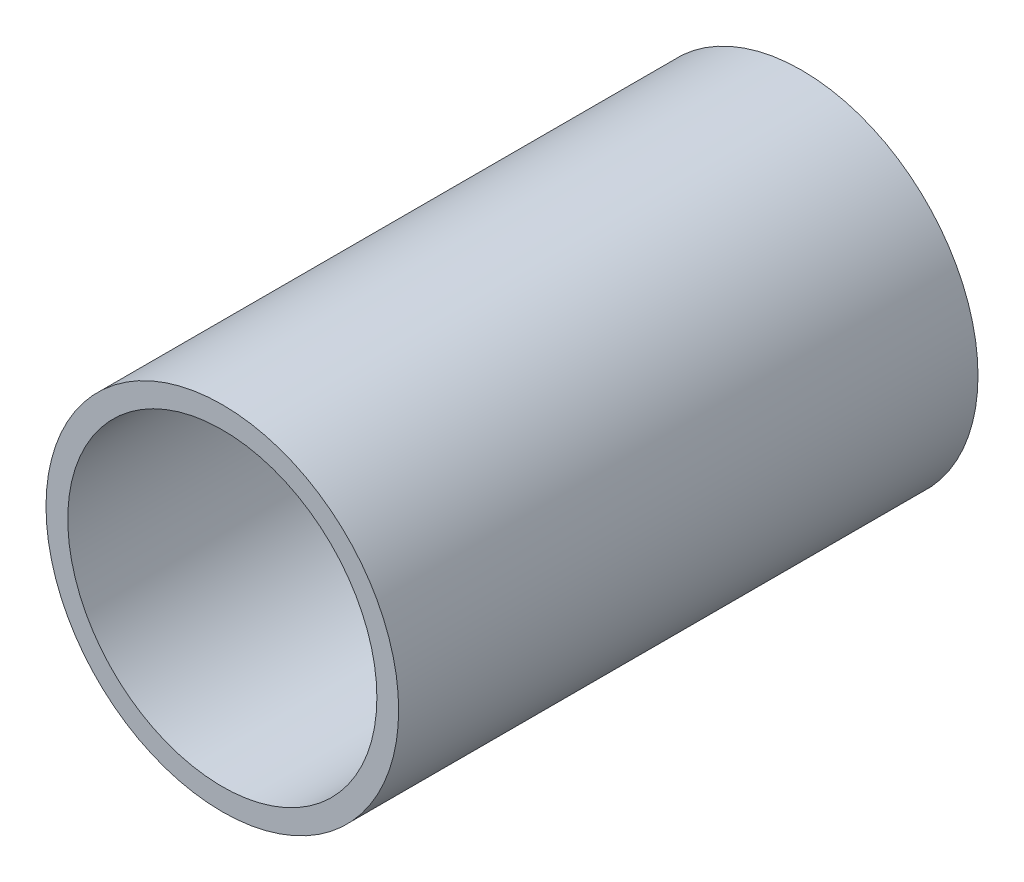
ISO-10303-21;
HEADER;
FILE_DESCRIPTION(('STEP AP214'),'2;1');
FILE_NAME('part.step','',(''),(''),'','','');
FILE_SCHEMA(('AUTOMOTIVE_DESIGN { 1 0 10303 214 1 1 1 1 }'));
ENDSEC;
DATA;
#1=APPLICATION_CONTEXT('core data for automotive mechanical design processes');
#2=APPLICATION_PROTOCOL_DEFINITION('international standard','automotive_design',2000,#1);
#3=PRODUCT_CONTEXT('',#1,'mechanical');
#4=PRODUCT('Part','Part','',(#3));
#5=PRODUCT_RELATED_PRODUCT_CATEGORY('part','',(#4));
#6=PRODUCT_DEFINITION_FORMATION('','',#4);
#7=PRODUCT_DEFINITION_CONTEXT('part definition',#1,'design');
#8=PRODUCT_DEFINITION('design','',#6,#7);
#9=PRODUCT_DEFINITION_SHAPE('','',#8);
#10=(LENGTH_UNIT() NAMED_UNIT(*) SI_UNIT(.MILLI.,.METRE.));
#11=(NAMED_UNIT(*) PLANE_ANGLE_UNIT() SI_UNIT($,.RADIAN.));
#12=(NAMED_UNIT(*) SI_UNIT($,.STERADIAN.) SOLID_ANGLE_UNIT());
#13=UNCERTAINTY_MEASURE_WITH_UNIT(LENGTH_MEASURE(1.E-05),#10,'distance_accuracy_value','');
#14=(GEOMETRIC_REPRESENTATION_CONTEXT(3) GLOBAL_UNCERTAINTY_ASSIGNED_CONTEXT((#13)) GLOBAL_UNIT_ASSIGNED_CONTEXT((#10,
#11,#12)) REPRESENTATION_CONTEXT('',''));
#15=CARTESIAN_POINT('',(0.,0.,0.));
#16=DIRECTION('',(0.,0.,1.));
#17=DIRECTION('',(1.,0.,0.));
#18=AXIS2_PLACEMENT_3D('',#15,#16,#17);
#19=CARTESIAN_POINT('',(0.,0.,73.025));
#20=DIRECTION('',(0.,0.,1.));
#21=DIRECTION('',(1.,0.,0.));
#22=AXIS2_PLACEMENT_3D('',#19,#20,#21);
#23=PLANE('',#22);
#24=CARTESIAN_POINT('',(0.,0.,73.025));
#25=DIRECTION('',(0.,0.,1.));
#26=DIRECTION('',(1.,0.,0.));
#27=AXIS2_PLACEMENT_3D('',#24,#25,#26);
#28=CIRCLE('',#27,44.45);
#29=CARTESIAN_POINT('',(44.45,0.,73.025));
#30=VERTEX_POINT('',#29);
#31=EDGE_CURVE('E11',#30,#30,#28,.T.);
#32=ORIENTED_EDGE('',*,*,#31,.T.);
#33=EDGE_LOOP('',(#32));
#34=FACE_BOUND('',#33,.T.);
#35=CARTESIAN_POINT('',(0.,0.,73.025));
#36=DIRECTION('',(0.,0.,1.));
#37=DIRECTION('',(1.,0.,0.));
#38=AXIS2_PLACEMENT_3D('',#35,#36,#37);
#39=CIRCLE('',#38,38.9636);
#40=CARTESIAN_POINT('',(38.9636,0.,73.025));
#41=VERTEX_POINT('',#40);
#42=EDGE_CURVE('E47',#41,#41,#39,.T.);
#43=ORIENTED_EDGE('',*,*,#42,.F.);
#44=EDGE_LOOP('',(#43));
#45=FACE_BOUND('',#44,.T.);
#46=ADVANCED_FACE('F36',(#34,#45),#23,.T.);
#47=CARTESIAN_POINT('',(0.,0.,-73.025));
#48=DIRECTION('',(0.,0.,1.));
#49=DIRECTION('',(1.,0.,0.));
#50=AXIS2_PLACEMENT_3D('',#47,#48,#49);
#51=PLANE('',#50);
#52=CARTESIAN_POINT('',(0.,0.,-73.025));
#53=DIRECTION('',(0.,0.,1.));
#54=DIRECTION('',(1.,0.,0.));
#55=AXIS2_PLACEMENT_3D('',#52,#53,#54);
#56=CIRCLE('',#55,44.45);
#57=CARTESIAN_POINT('',(44.45,0.,-73.025));
#58=VERTEX_POINT('',#57);
#59=EDGE_CURVE('E40',#58,#58,#56,.T.);
#60=ORIENTED_EDGE('',*,*,#59,.F.);
#61=EDGE_LOOP('',(#60));
#62=FACE_BOUND('',#61,.T.);
#63=CARTESIAN_POINT('',(0.,0.,-73.025));
#64=DIRECTION('',(0.,0.,1.));
#65=DIRECTION('',(1.,0.,0.));
#66=AXIS2_PLACEMENT_3D('',#63,#64,#65);
#67=CIRCLE('',#66,38.9636);
#68=CARTESIAN_POINT('',(38.9636,0.,-73.025));
#69=VERTEX_POINT('',#68);
#70=EDGE_CURVE('E49',#69,#69,#67,.T.);
#71=ORIENTED_EDGE('',*,*,#70,.T.);
#72=EDGE_LOOP('',(#71));
#73=FACE_BOUND('',#72,.T.);
#74=ADVANCED_FACE('F59',(#62,#73),#51,.F.);
#75=CARTESIAN_POINT('',(0.,0.,73.025));
#76=DIRECTION('',(0.,0.,-1.));
#77=DIRECTION('',(-1.,0.,0.));
#78=AXIS2_PLACEMENT_3D('',#75,#76,#77);
#79=CYLINDRICAL_SURFACE('',#78,44.45);
#80=ORIENTED_EDGE('',*,*,#31,.F.);
#81=EDGE_LOOP('',(#80));
#82=FACE_BOUND('',#81,.T.);
#83=ORIENTED_EDGE('',*,*,#59,.T.);
#84=EDGE_LOOP('',(#83));
#85=FACE_BOUND('',#84,.T.);
#86=ADVANCED_FACE('F38',(#82,#85),#79,.T.);
#87=CARTESIAN_POINT('',(0.,0.,73.025));
#88=DIRECTION('',(0.,0.,-1.));
#89=DIRECTION('',(-1.,0.,0.));
#90=AXIS2_PLACEMENT_3D('',#87,#88,#89);
#91=CYLINDRICAL_SURFACE('',#90,38.9636);
#92=ORIENTED_EDGE('',*,*,#42,.T.);
#93=EDGE_LOOP('',(#92));
#94=FACE_BOUND('',#93,.T.);
#95=ORIENTED_EDGE('',*,*,#70,.F.);
#96=EDGE_LOOP('',(#95));
#97=FACE_BOUND('',#96,.T.);
#98=ADVANCED_FACE('F55',(#94,#97),#91,.F.);
#99=CLOSED_SHELL('',(#46,#74,#86,#98));
#100=MANIFOLD_SOLID_BREP('B2',#99);
#101=ADVANCED_BREP_SHAPE_REPRESENTATION('',(#18,#100),#14);
#102=SHAPE_DEFINITION_REPRESENTATION(#9,#101);
ENDSEC;
END-ISO-10303-21;
